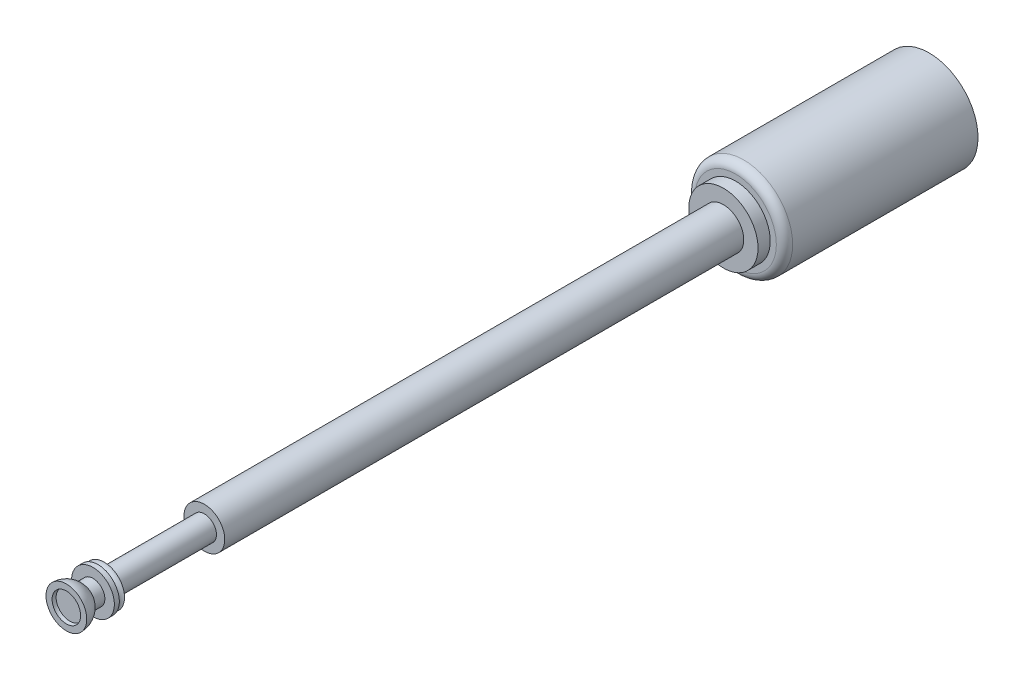
ISO-10303-21;
HEADER;
FILE_DESCRIPTION(('STEP AP214'),'2;1');
FILE_NAME('part.step','',(''),(''),'','','');
FILE_SCHEMA(('AUTOMOTIVE_DESIGN { 1 0 10303 214 1 1 1 1 }'));
ENDSEC;
DATA;
#1=APPLICATION_CONTEXT('core data for automotive mechanical design processes');
#2=APPLICATION_PROTOCOL_DEFINITION('international standard','automotive_design',2000,#1);
#3=PRODUCT_CONTEXT('',#1,'mechanical');
#4=PRODUCT('Part','Part','',(#3));
#5=PRODUCT_RELATED_PRODUCT_CATEGORY('part','',(#4));
#6=PRODUCT_DEFINITION_FORMATION('','',#4);
#7=PRODUCT_DEFINITION_CONTEXT('part definition',#1,'design');
#8=PRODUCT_DEFINITION('design','',#6,#7);
#9=PRODUCT_DEFINITION_SHAPE('','',#8);
#10=(LENGTH_UNIT() NAMED_UNIT(*) SI_UNIT(.MILLI.,.METRE.));
#11=(NAMED_UNIT(*) PLANE_ANGLE_UNIT() SI_UNIT($,.RADIAN.));
#12=(NAMED_UNIT(*) SI_UNIT($,.STERADIAN.) SOLID_ANGLE_UNIT());
#13=UNCERTAINTY_MEASURE_WITH_UNIT(LENGTH_MEASURE(1.E-05),#10,'distance_accuracy_value','');
#14=(GEOMETRIC_REPRESENTATION_CONTEXT(3) GLOBAL_UNCERTAINTY_ASSIGNED_CONTEXT((#13)) GLOBAL_UNIT_ASSIGNED_CONTEXT((#10,
#11,#12)) REPRESENTATION_CONTEXT('',''));
#15=CARTESIAN_POINT('',(0.,0.,0.));
#16=DIRECTION('',(0.,0.,1.));
#17=DIRECTION('',(1.,0.,0.));
#18=AXIS2_PLACEMENT_3D('',#15,#16,#17);
#19=CARTESIAN_POINT('',(0.,0.,16.4275));
#20=DIRECTION('',(0.,0.,-1.));
#21=DIRECTION('',(1.,0.,0.));
#22=AXIS2_PLACEMENT_3D('',#19,#20,#21);
#23=SPHERICAL_SURFACE('',#22,0.35);
#24=CARTESIAN_POINT('',(0.,0.,16.4275));
#25=DIRECTION('',(0.,0.,-1.));
#26=DIRECTION('',(-1.,0.,0.));
#27=AXIS2_PLACEMENT_3D('',#24,#25,#26);
#28=CIRCLE('',#27,0.35);
#29=CARTESIAN_POINT('',(-0.35,0.,16.4275));
#30=VERTEX_POINT('',#29);
#31=EDGE_CURVE('E88',#30,#30,#28,.T.);
#32=ORIENTED_EDGE('',*,*,#31,.F.);
#33=EDGE_LOOP('',(#32));
#34=FACE_BOUND('',#33,.T.);
#35=CARTESIAN_POINT('',(0.,0.,16.34));
#36=DIRECTION('',(0.,0.,-1.));
#37=DIRECTION('',(-1.,0.,0.));
#38=AXIS2_PLACEMENT_3D('',#35,#36,#37);
#39=CIRCLE('',#38,0.338886042793149);
#40=CARTESIAN_POINT('',(-0.338886042793149,0.,16.34));
#41=VERTEX_POINT('',#40);
#42=EDGE_CURVE('E10',#41,#41,#39,.F.);
#43=ORIENTED_EDGE('',*,*,#42,.F.);
#44=EDGE_LOOP('',(#43));
#45=FACE_BOUND('',#44,.T.);
#46=ADVANCED_FACE('F37',(#34,#45),#23,.F.);
#47=CARTESIAN_POINT('',(0.,0.,15.6524171350072));
#48=DIRECTION('',(0.,0.,-1.));
#49=DIRECTION('',(-1.,0.,0.));
#50=AXIS2_PLACEMENT_3D('',#47,#48,#49);
#51=TOROIDAL_SURFACE('',#50,0.532645656750103,0.155874057971298);
#52=CARTESIAN_POINT('',(0.,0.,15.5));
#53=DIRECTION('',(0.,0.,-1.));
#54=DIRECTION('',(-1.,0.,0.));
#55=AXIS2_PLACEMENT_3D('',#52,#53,#54);
#56=CIRCLE('',#55,0.5);
#57=CARTESIAN_POINT('',(-0.5,0.,15.5));
#58=VERTEX_POINT('',#57);
#59=EDGE_CURVE('E91',#58,#58,#56,.F.);
#60=ORIENTED_EDGE('',*,*,#59,.T.);
#61=EDGE_LOOP('',(#60));
#62=FACE_BOUND('',#61,.T.);
#63=CARTESIAN_POINT('',(0.,0.,15.6524171350072));
#64=DIRECTION('',(0.,0.,-1.));
#65=DIRECTION('',(-1.,0.,0.));
#66=AXIS2_PLACEMENT_3D('',#63,#64,#65);
#67=CIRCLE('',#66,0.376771598778805);
#68=CARTESIAN_POINT('',(-0.376771598778805,0.,15.6524171350072));
#69=VERTEX_POINT('',#68);
#70=EDGE_CURVE('E68',#69,#69,#67,.T.);
#71=ORIENTED_EDGE('',*,*,#70,.T.);
#72=EDGE_LOOP('',(#71));
#73=FACE_BOUND('',#72,.T.);
#74=ADVANCED_FACE('F110',(#62,#73),#51,.F.);
#75=CARTESIAN_POINT('',(0.524883028319991,0.,15.6524171350072));
#76=DIRECTION('',(0.,0.,1.));
#77=DIRECTION('',(1.,0.,0.));
#78=AXIS2_PLACEMENT_3D('',#75,#76,#77);
#79=PLANE('',#78);
#80=ORIENTED_EDGE('',*,*,#70,.F.);
#81=EDGE_LOOP('',(#80));
#82=FACE_BOUND('',#81,.T.);
#83=CARTESIAN_POINT('',(0.,0.,15.6524171350072));
#84=DIRECTION('',(0.,0.,-1.));
#85=DIRECTION('',(-1.,0.,0.));
#86=AXIS2_PLACEMENT_3D('',#83,#84,#85);
#87=CIRCLE('',#86,0.524883028319991);
#88=CARTESIAN_POINT('',(-0.524883028319991,0.,15.6524171350072));
#89=VERTEX_POINT('',#88);
#90=EDGE_CURVE('E73',#89,#89,#87,.T.);
#91=ORIENTED_EDGE('',*,*,#90,.T.);
#92=EDGE_LOOP('',(#91));
#93=FACE_BOUND('',#92,.T.);
#94=ADVANCED_FACE('F113',(#82,#93),#79,.F.);
#95=CARTESIAN_POINT('',(0.,0.,15.5));
#96=DIRECTION('',(0.,0.,-1.));
#97=DIRECTION('',(-1.,0.,0.));
#98=AXIS2_PLACEMENT_3D('',#95,#96,#97);
#99=CYLINDRICAL_SURFACE('',#98,0.524883028319991);
#100=ORIENTED_EDGE('',*,*,#90,.F.);
#101=EDGE_LOOP('',(#100));
#102=FACE_BOUND('',#101,.T.);
#103=CARTESIAN_POINT('',(0.,0.,15.7742403137326));
#104=DIRECTION('',(0.,0.,-1.));
#105=DIRECTION('',(-1.,0.,0.));
#106=AXIS2_PLACEMENT_3D('',#103,#104,#105);
#107=CIRCLE('',#106,0.524883028319991);
#108=CARTESIAN_POINT('',(-0.524883028319991,0.,15.7742403137326));
#109=VERTEX_POINT('',#108);
#110=EDGE_CURVE('E76',#109,#109,#107,.T.);
#111=ORIENTED_EDGE('',*,*,#110,.T.);
#112=EDGE_LOOP('',(#111));
#113=FACE_BOUND('',#112,.T.);
#114=ADVANCED_FACE('F119',(#102,#113),#99,.T.);
#115=CARTESIAN_POINT('',(0.29173930572969,0.,15.7742403137326));
#116=DIRECTION('',(0.,0.,-1.));
#117=DIRECTION('',(-1.,0.,0.));
#118=AXIS2_PLACEMENT_3D('',#115,#116,#117);
#119=PLANE('',#118);
#120=ORIENTED_EDGE('',*,*,#110,.F.);
#121=EDGE_LOOP('',(#120));
#122=FACE_BOUND('',#121,.T.);
#123=CARTESIAN_POINT('',(0.,0.,15.7742403137326));
#124=DIRECTION('',(0.,0.,-1.));
#125=DIRECTION('',(-1.,0.,0.));
#126=AXIS2_PLACEMENT_3D('',#123,#124,#125);
#127=CIRCLE('',#126,0.29173930572969);
#128=CARTESIAN_POINT('',(-0.29173930572969,0.,15.7742403137326));
#129=VERTEX_POINT('',#128);
#130=EDGE_CURVE('E79',#129,#129,#127,.T.);
#131=ORIENTED_EDGE('',*,*,#130,.T.);
#132=EDGE_LOOP('',(#131));
#133=FACE_BOUND('',#132,.T.);
#134=ADVANCED_FACE('F125',(#122,#133),#119,.F.);
#135=CARTESIAN_POINT('',(0.,0.,15.5));
#136=DIRECTION('',(0.,0.,-1.));
#137=DIRECTION('',(-1.,0.,0.));
#138=AXIS2_PLACEMENT_3D('',#135,#136,#137);
#139=CYLINDRICAL_SURFACE('',#138,0.29173930572969);
#140=ORIENTED_EDGE('',*,*,#130,.F.);
#141=EDGE_LOOP('',(#140));
#142=FACE_BOUND('',#141,.T.);
#143=CARTESIAN_POINT('',(0.,0.,16.0214357470888));
#144=DIRECTION('',(0.,0.,-1.));
#145=DIRECTION('',(-1.,0.,0.));
#146=AXIS2_PLACEMENT_3D('',#143,#144,#145);
#147=CIRCLE('',#146,0.29173930572969);
#148=CARTESIAN_POINT('',(-0.29173930572969,0.,16.0214357470888));
#149=VERTEX_POINT('',#148);
#150=EDGE_CURVE('E82',#149,#149,#147,.T.);
#151=ORIENTED_EDGE('',*,*,#150,.T.);
#152=EDGE_LOOP('',(#151));
#153=FACE_BOUND('',#152,.T.);
#154=ADVANCED_FACE('F131',(#142,#153),#139,.T.);
#155=CARTESIAN_POINT('',(0.,0.,16.4275));
#156=DIRECTION('',(0.,0.,-1.));
#157=DIRECTION('',(1.,0.,0.));
#158=AXIS2_PLACEMENT_3D('',#155,#156,#157);
#159=SPHERICAL_SURFACE('',#158,0.5);
#160=ORIENTED_EDGE('',*,*,#150,.F.);
#161=EDGE_LOOP('',(#160));
#162=FACE_BOUND('',#161,.T.);
#163=CARTESIAN_POINT('',(0.,0.,16.4275));
#164=DIRECTION('',(0.,0.,-1.));
#165=DIRECTION('',(-1.,0.,0.));
#166=AXIS2_PLACEMENT_3D('',#163,#164,#165);
#167=CIRCLE('',#166,0.5);
#168=CARTESIAN_POINT('',(-0.5,0.,16.4275));
#169=VERTEX_POINT('',#168);
#170=EDGE_CURVE('E85',#169,#169,#167,.T.);
#171=ORIENTED_EDGE('',*,*,#170,.T.);
#172=EDGE_LOOP('',(#171));
#173=FACE_BOUND('',#172,.T.);
#174=ADVANCED_FACE('F137',(#162,#173),#159,.T.);
#175=CARTESIAN_POINT('',(0.35,0.,16.4275));
#176=DIRECTION('',(0.,0.,-1.));
#177=DIRECTION('',(-1.,0.,0.));
#178=AXIS2_PLACEMENT_3D('',#175,#176,#177);
#179=PLANE('',#178);
#180=ORIENTED_EDGE('',*,*,#170,.F.);
#181=EDGE_LOOP('',(#180));
#182=FACE_BOUND('',#181,.T.);
#183=ORIENTED_EDGE('',*,*,#31,.T.);
#184=EDGE_LOOP('',(#183));
#185=FACE_BOUND('',#184,.T.);
#186=ADVANCED_FACE('F143',(#182,#185),#179,.F.);
#187=CARTESIAN_POINT('',(0.,0.,16.34));
#188=DIRECTION('',(0.,0.,-1.));
#189=DIRECTION('',(-1.,0.,0.));
#190=AXIS2_PLACEMENT_3D('',#187,#188,#189);
#191=PLANE('',#190);
#192=ORIENTED_EDGE('',*,*,#42,.T.);
#193=EDGE_LOOP('',(#192));
#194=FACE_BOUND('',#193,.T.);
#195=ADVANCED_FACE('F149',(#194),#191,.F.);
#196=CARTESIAN_POINT('',(-0.2962,0.,13.04));
#197=DIRECTION('',(0.,0.,-1.));
#198=DIRECTION('',(-1.,0.,0.));
#199=AXIS2_PLACEMENT_3D('',#196,#197,#198);
#200=PLANE('',#199);
#201=CARTESIAN_POINT('',(0.,0.,13.04));
#202=DIRECTION('',(0.,0.,-1.));
#203=DIRECTION('',(-1.,0.,0.));
#204=AXIS2_PLACEMENT_3D('',#201,#202,#203);
#205=CIRCLE('',#204,0.2962);
#206=CARTESIAN_POINT('',(-0.2962,0.,13.04));
#207=VERTEX_POINT('',#206);
#208=EDGE_CURVE('E94',#207,#207,#205,.T.);
#209=ORIENTED_EDGE('',*,*,#208,.T.);
#210=EDGE_LOOP('',(#209));
#211=FACE_BOUND('',#210,.T.);
#212=CARTESIAN_POINT('',(0.,0.,13.04));
#213=DIRECTION('',(0.,0.,-1.));
#214=DIRECTION('',(-1.,0.,0.));
#215=AXIS2_PLACEMENT_3D('',#212,#213,#214);
#216=CIRCLE('',#215,0.5);
#217=CARTESIAN_POINT('',(-0.5,0.,13.04));
#218=VERTEX_POINT('',#217);
#219=EDGE_CURVE('E41',#218,#218,#216,.T.);
#220=ORIENTED_EDGE('',*,*,#219,.F.);
#221=EDGE_LOOP('',(#220));
#222=FACE_BOUND('',#221,.T.);
#223=ADVANCED_FACE('F106',(#211,#222),#200,.F.);
#224=CARTESIAN_POINT('',(-0.2962,0.,15.5));
#225=DIRECTION('',(0.,0.,1.));
#226=DIRECTION('',(1.,0.,0.));
#227=AXIS2_PLACEMENT_3D('',#224,#225,#226);
#228=PLANE('',#227);
#229=CARTESIAN_POINT('',(0.,0.,15.5));
#230=DIRECTION('',(0.,0.,-1.));
#231=DIRECTION('',(-1.,0.,0.));
#232=AXIS2_PLACEMENT_3D('',#229,#230,#231);
#233=CIRCLE('',#232,0.2962);
#234=CARTESIAN_POINT('',(-0.2962,0.,15.5));
#235=VERTEX_POINT('',#234);
#236=EDGE_CURVE('E97',#235,#235,#233,.T.);
#237=ORIENTED_EDGE('',*,*,#236,.F.);
#238=EDGE_LOOP('',(#237));
#239=FACE_BOUND('',#238,.T.);
#240=ORIENTED_EDGE('',*,*,#59,.F.);
#241=EDGE_LOOP('',(#240));
#242=FACE_BOUND('',#241,.T.);
#243=ADVANCED_FACE('F103',(#239,#242),#228,.F.);
#244=CARTESIAN_POINT('',(0.,0.,15.5));
#245=DIRECTION('',(0.,0.,-1.));
#246=DIRECTION('',(-1.,0.,0.));
#247=AXIS2_PLACEMENT_3D('',#244,#245,#246);
#248=CYLINDRICAL_SURFACE('',#247,0.2962);
#249=ORIENTED_EDGE('',*,*,#208,.F.);
#250=EDGE_LOOP('',(#249));
#251=FACE_BOUND('',#250,.T.);
#252=ORIENTED_EDGE('',*,*,#236,.T.);
#253=EDGE_LOOP('',(#252));
#254=FACE_BOUND('',#253,.T.);
#255=ADVANCED_FACE('F101',(#251,#254),#248,.T.);
#256=CARTESIAN_POINT('',(0.,0.,-4.75));
#257=DIRECTION('',(0.,0.,-1.));
#258=DIRECTION('',(-1.,0.,0.));
#259=AXIS2_PLACEMENT_3D('',#256,#257,#258);
#260=PLANE('',#259);
#261=CARTESIAN_POINT('',(0.,0.,-4.75));
#262=DIRECTION('',(0.,0.,1.));
#263=DIRECTION('',(1.,0.,0.));
#264=AXIS2_PLACEMENT_3D('',#261,#262,#263);
#265=CIRCLE('',#264,1.2);
#266=CARTESIAN_POINT('',(1.2,0.,-4.75));
#267=VERTEX_POINT('',#266);
#268=EDGE_CURVE('E56',#267,#267,#265,.T.);
#269=ORIENTED_EDGE('',*,*,#268,.F.);
#270=EDGE_LOOP('',(#269));
#271=FACE_BOUND('',#270,.T.);
#272=ADVANCED_FACE('F215',(#271),#260,.T.);
#273=CARTESIAN_POINT('',(0.,0.,-4.75));
#274=DIRECTION('',(0.,0.,1.));
#275=DIRECTION('',(1.,0.,0.));
#276=AXIS2_PLACEMENT_3D('',#273,#274,#275);
#277=CYLINDRICAL_SURFACE('',#276,1.2);
#278=CARTESIAN_POINT('',(0.,0.,-0.2));
#279=DIRECTION('',(0.,0.,1.));
#280=DIRECTION('',(1.,0.,0.));
#281=AXIS2_PLACEMENT_3D('',#278,#279,#280);
#282=CIRCLE('',#281,1.2);
#283=CARTESIAN_POINT('',(1.2,0.,-0.2));
#284=VERTEX_POINT('',#283);
#285=EDGE_CURVE('E50',#284,#284,#282,.F.);
#286=ORIENTED_EDGE('',*,*,#285,.T.);
#287=EDGE_LOOP('',(#286));
#288=FACE_BOUND('',#287,.T.);
#289=ORIENTED_EDGE('',*,*,#268,.T.);
#290=EDGE_LOOP('',(#289));
#291=FACE_BOUND('',#290,.T.);
#292=ADVANCED_FACE('F210',(#288,#291),#277,.T.);
#293=CARTESIAN_POINT('',(0.,0.,-0.2));
#294=DIRECTION('',(0.,0.,1.));
#295=DIRECTION('',(1.,0.,0.));
#296=AXIS2_PLACEMENT_3D('',#293,#294,#295);
#297=TOROIDAL_SURFACE('',#296,1.,0.2);
#298=ORIENTED_EDGE('',*,*,#285,.F.);
#299=EDGE_LOOP('',(#298));
#300=FACE_BOUND('',#299,.T.);
#301=CARTESIAN_POINT('',(0.,0.,0.));
#302=DIRECTION('',(0.,0.,1.));
#303=DIRECTION('',(1.,0.,0.));
#304=AXIS2_PLACEMENT_3D('',#301,#302,#303);
#305=CIRCLE('',#304,1.);
#306=CARTESIAN_POINT('',(1.,0.,0.));
#307=VERTEX_POINT('',#306);
#308=EDGE_CURVE('E60',#307,#307,#305,.T.);
#309=ORIENTED_EDGE('',*,*,#308,.F.);
#310=EDGE_LOOP('',(#309));
#311=FACE_BOUND('',#310,.T.);
#312=ADVANCED_FACE('F39',(#300,#311),#297,.T.);
#313=CARTESIAN_POINT('',(0.,0.,0.));
#314=DIRECTION('',(0.,0.,1.));
#315=DIRECTION('',(1.,0.,0.));
#316=AXIS2_PLACEMENT_3D('',#313,#314,#315);
#317=PLANE('',#316);
#318=CARTESIAN_POINT('',(0.,0.,0.));
#319=DIRECTION('',(0.,0.,1.));
#320=DIRECTION('',(1.,0.,0.));
#321=AXIS2_PLACEMENT_3D('',#318,#319,#320);
#322=CIRCLE('',#321,0.85);
#323=CARTESIAN_POINT('',(0.85,0.,0.));
#324=VERTEX_POINT('',#323);
#325=EDGE_CURVE('E65',#324,#324,#322,.T.);
#326=ORIENTED_EDGE('',*,*,#325,.F.);
#327=EDGE_LOOP('',(#326));
#328=FACE_BOUND('',#327,.T.);
#329=ORIENTED_EDGE('',*,*,#308,.T.);
#330=EDGE_LOOP('',(#329));
#331=FACE_BOUND('',#330,.T.);
#332=ADVANCED_FACE('F200',(#328,#331),#317,.T.);
#333=CARTESIAN_POINT('',(0.,0.,0.3));
#334=DIRECTION('',(0.,0.,-1.));
#335=DIRECTION('',(-1.,0.,0.));
#336=AXIS2_PLACEMENT_3D('',#333,#334,#335);
#337=CYLINDRICAL_SURFACE('',#336,0.85);
#338=CARTESIAN_POINT('',(0.,0.,0.3));
#339=DIRECTION('',(0.,0.,1.));
#340=DIRECTION('',(1.,0.,0.));
#341=AXIS2_PLACEMENT_3D('',#338,#339,#340);
#342=CIRCLE('',#341,0.85);
#343=CARTESIAN_POINT('',(0.85,0.,0.3));
#344=VERTEX_POINT('',#343);
#345=EDGE_CURVE('E57',#344,#344,#342,.T.);
#346=ORIENTED_EDGE('',*,*,#345,.F.);
#347=EDGE_LOOP('',(#346));
#348=FACE_BOUND('',#347,.T.);
#349=ORIENTED_EDGE('',*,*,#325,.T.);
#350=EDGE_LOOP('',(#349));
#351=FACE_BOUND('',#350,.T.);
#352=ADVANCED_FACE('F194',(#348,#351),#337,.T.);
#353=CARTESIAN_POINT('',(0.,0.,0.3));
#354=DIRECTION('',(0.,0.,1.));
#355=DIRECTION('',(1.,0.,0.));
#356=AXIS2_PLACEMENT_3D('',#353,#354,#355);
#357=PLANE('',#356);
#358=CARTESIAN_POINT('',(0.,0.,0.3));
#359=DIRECTION('',(0.,0.,1.));
#360=DIRECTION('',(1.,0.,0.));
#361=AXIS2_PLACEMENT_3D('',#358,#359,#360);
#362=CIRCLE('',#361,0.5);
#363=CARTESIAN_POINT('',(0.5,0.,0.3));
#364=VERTEX_POINT('',#363);
#365=EDGE_CURVE('E53',#364,#364,#362,.T.);
#366=ORIENTED_EDGE('',*,*,#365,.F.);
#367=EDGE_LOOP('',(#366));
#368=FACE_BOUND('',#367,.T.);
#369=ORIENTED_EDGE('',*,*,#345,.T.);
#370=EDGE_LOOP('',(#369));
#371=FACE_BOUND('',#370,.T.);
#372=ADVANCED_FACE('F189',(#368,#371),#357,.T.);
#373=CARTESIAN_POINT('',(0.,0.,15.5));
#374=DIRECTION('',(0.,0.,-1.));
#375=DIRECTION('',(-1.,0.,0.));
#376=AXIS2_PLACEMENT_3D('',#373,#374,#375);
#377=CYLINDRICAL_SURFACE('',#376,0.5);
#378=ORIENTED_EDGE('',*,*,#219,.T.);
#379=EDGE_LOOP('',(#378));
#380=FACE_BOUND('',#379,.T.);
#381=ORIENTED_EDGE('',*,*,#365,.T.);
#382=EDGE_LOOP('',(#381));
#383=FACE_BOUND('',#382,.T.);
#384=ADVANCED_FACE('F187',(#380,#383),#377,.T.);
#385=CLOSED_SHELL('',(#46,#74,#94,#114,#134,#154,#174,#186,#195,#223,#243,#255,#272,#292,#312,
#332,#352,#372,#384));
#386=CARTESIAN_POINT('',(0.,0.,16.3086777385038));
#387=DIRECTION('',(0.,0.,1.));
#388=DIRECTION('',(1.,0.,0.));
#389=AXIS2_PLACEMENT_3D('',#386,#387,#388);
#390=PLANE('',#389);
#391=CARTESIAN_POINT('',(0.,0.,16.3086777385038));
#392=DIRECTION('',(0.,0.,1.));
#393=DIRECTION('',(1.,0.,0.));
#394=AXIS2_PLACEMENT_3D('',#391,#392,#393);
#395=CIRCLE('',#394,0.329213107535104);
#396=CARTESIAN_POINT('',(0.329213107535104,0.,16.3086777385038));
#397=VERTEX_POINT('',#396);
#398=EDGE_CURVE('E46',#397,#397,#395,.F.);
#399=ORIENTED_EDGE('',*,*,#398,.T.);
#400=EDGE_LOOP('',(#399));
#401=FACE_BOUND('',#400,.T.);
#402=ADVANCED_FACE('F161',(#401),#390,.F.);
#403=ORIENTED_EDGE('',*,*,#398,.F.);
#404=EDGE_LOOP('',(#403));
#405=FACE_BOUND('',#404,.T.);
#406=ADVANCED_FACE('F156',(#405),#23,.F.);
#407=CLOSED_SHELL('',(#402,#406));
#408=ORIENTED_CLOSED_SHELL('',*,#407,.T.);
#409=BREP_WITH_VOIDS('B2',#385,(#408));
#410=ADVANCED_BREP_SHAPE_REPRESENTATION('',(#18,#409),#14);
#411=SHAPE_DEFINITION_REPRESENTATION(#9,#410);
ENDSEC;
END-ISO-10303-21;
